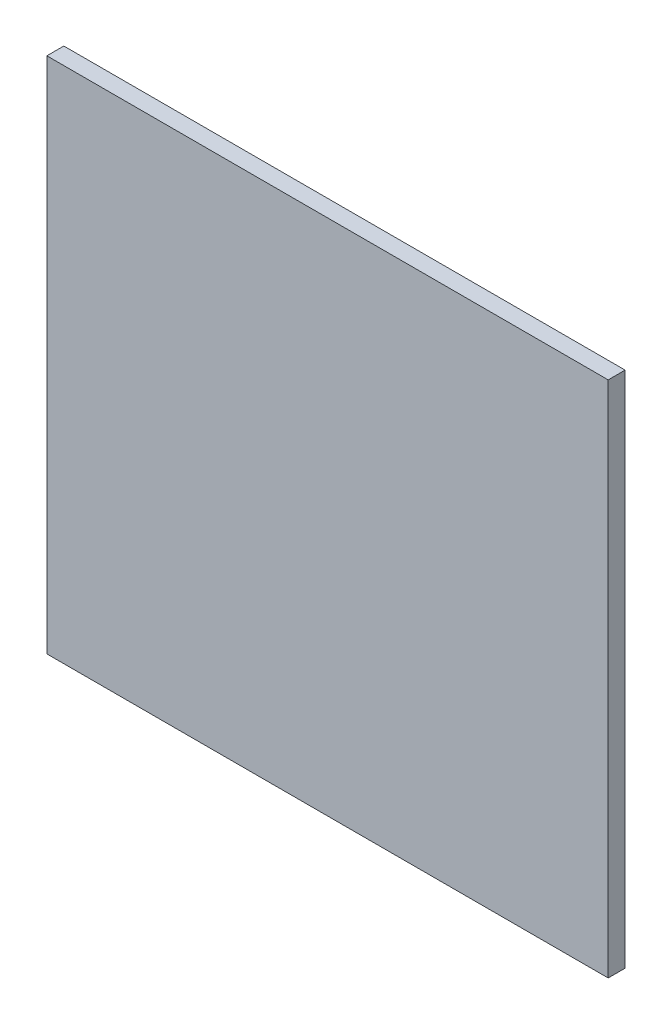
ISO-10303-21;
HEADER;
FILE_DESCRIPTION(('STEP AP214'),'2;1');
FILE_NAME('part.step','',(''),(''),'','','');
FILE_SCHEMA(('AUTOMOTIVE_DESIGN { 1 0 10303 214 1 1 1 1 }'));
ENDSEC;
DATA;
#1=APPLICATION_CONTEXT('core data for automotive mechanical design processes');
#2=APPLICATION_PROTOCOL_DEFINITION('international standard','automotive_design',2000,#1);
#3=PRODUCT_CONTEXT('',#1,'mechanical');
#4=PRODUCT('Part','Part','',(#3));
#5=PRODUCT_RELATED_PRODUCT_CATEGORY('part','',(#4));
#6=PRODUCT_DEFINITION_FORMATION('','',#4);
#7=PRODUCT_DEFINITION_CONTEXT('part definition',#1,'design');
#8=PRODUCT_DEFINITION('design','',#6,#7);
#9=PRODUCT_DEFINITION_SHAPE('','',#8);
#10=(LENGTH_UNIT() NAMED_UNIT(*) SI_UNIT(.MILLI.,.METRE.));
#11=(NAMED_UNIT(*) PLANE_ANGLE_UNIT() SI_UNIT($,.RADIAN.));
#12=(NAMED_UNIT(*) SI_UNIT($,.STERADIAN.) SOLID_ANGLE_UNIT());
#13=UNCERTAINTY_MEASURE_WITH_UNIT(LENGTH_MEASURE(1.E-05),#10,'distance_accuracy_value','');
#14=(GEOMETRIC_REPRESENTATION_CONTEXT(3) GLOBAL_UNCERTAINTY_ASSIGNED_CONTEXT((#13)) GLOBAL_UNIT_ASSIGNED_CONTEXT((#10,
#11,#12)) REPRESENTATION_CONTEXT('',''));
#15=CARTESIAN_POINT('',(0.,0.,0.));
#16=DIRECTION('',(0.,0.,1.));
#17=DIRECTION('',(1.,0.,0.));
#18=AXIS2_PLACEMENT_3D('',#15,#16,#17);
#19=CARTESIAN_POINT('',(-47.7511842591412,-36.5014710691867,18.));
#20=DIRECTION('',(1.,0.,0.));
#21=DIRECTION('',(0.,0.,-1.));
#22=AXIS2_PLACEMENT_3D('',#19,#20,#21);
#23=PLANE('',#22);
#24=DIRECTION('',(0.,-1.,0.));
#25=VECTOR('',#24,1.);
#26=CARTESIAN_POINT('',(-47.7511842591412,-36.5014710691867,0.));
#27=LINE('',#26,#25);
#28=CARTESIAN_POINT('',(-47.7511842591412,513.498528930813,0.));
#29=VERTEX_POINT('',#28);
#30=CARTESIAN_POINT('',(-47.7511842591412,-36.5014710691867,0.));
#31=VERTEX_POINT('',#30);
#32=EDGE_CURVE('E96',#29,#31,#27,.T.);
#33=ORIENTED_EDGE('',*,*,#32,.T.);
#34=DIRECTION('',(0.,0.,-1.));
#35=VECTOR('',#34,1.);
#36=CARTESIAN_POINT('',(-47.7511842591412,-36.5014710691867,18.));
#37=LINE('',#36,#35);
#38=CARTESIAN_POINT('',(-47.7511842591412,-36.5014710691867,18.));
#39=VERTEX_POINT('',#38);
#40=EDGE_CURVE('E11',#39,#31,#37,.T.);
#41=ORIENTED_EDGE('',*,*,#40,.F.);
#42=DIRECTION('',(0.,-1.,0.));
#43=VECTOR('',#42,1.);
#44=CARTESIAN_POINT('',(-47.7511842591412,-36.5014710691867,18.));
#45=LINE('',#44,#43);
#46=CARTESIAN_POINT('',(-47.7511842591412,513.498528930813,18.));
#47=VERTEX_POINT('',#46);
#48=EDGE_CURVE('E84',#47,#39,#45,.T.);
#49=ORIENTED_EDGE('',*,*,#48,.F.);
#50=DIRECTION('',(0.,0.,-1.));
#51=VECTOR('',#50,1.);
#52=CARTESIAN_POINT('',(-47.7511842591412,513.498528930813,18.));
#53=LINE('',#52,#51);
#54=EDGE_CURVE('E92',#47,#29,#53,.T.);
#55=ORIENTED_EDGE('',*,*,#54,.T.);
#56=EDGE_LOOP('',(#33,#41,#49,#55));
#57=FACE_BOUND('',#56,.T.);
#58=ADVANCED_FACE('F33',(#57),#23,.F.);
#59=CARTESIAN_POINT('',(548.248815740859,-36.5014710691866,18.));
#60=DIRECTION('',(0.,1.,0.));
#61=DIRECTION('',(-1.,0.,0.));
#62=AXIS2_PLACEMENT_3D('',#59,#60,#61);
#63=PLANE('',#62);
#64=DIRECTION('',(1.,0.,0.));
#65=VECTOR('',#64,1.);
#66=CARTESIAN_POINT('',(548.248815740859,-36.5014710691866,0.));
#67=LINE('',#66,#65);
#68=CARTESIAN_POINT('',(548.248815740859,-36.5014710691866,0.));
#69=VERTEX_POINT('',#68);
#70=EDGE_CURVE('E88',#31,#69,#67,.T.);
#71=ORIENTED_EDGE('',*,*,#70,.T.);
#72=DIRECTION('',(0.,0.,-1.));
#73=VECTOR('',#72,1.);
#74=CARTESIAN_POINT('',(548.248815740859,-36.5014710691866,18.));
#75=LINE('',#74,#73);
#76=CARTESIAN_POINT('',(548.248815740859,-36.5014710691866,18.));
#77=VERTEX_POINT('',#76);
#78=EDGE_CURVE('E41',#77,#69,#75,.T.);
#79=ORIENTED_EDGE('',*,*,#78,.F.);
#80=DIRECTION('',(1.,0.,0.));
#81=VECTOR('',#80,1.);
#82=CARTESIAN_POINT('',(548.248815740859,-36.5014710691866,18.));
#83=LINE('',#82,#81);
#84=EDGE_CURVE('E79',#39,#77,#83,.T.);
#85=ORIENTED_EDGE('',*,*,#84,.F.);
#86=ORIENTED_EDGE('',*,*,#40,.T.);
#87=EDGE_LOOP('',(#71,#79,#85,#86));
#88=FACE_BOUND('',#87,.T.);
#89=ADVANCED_FACE('F87',(#88),#63,.F.);
#90=CARTESIAN_POINT('',(548.248815740859,-36.5014710691866,18.));
#91=DIRECTION('',(-1.,0.,0.));
#92=DIRECTION('',(0.,0.,1.));
#93=AXIS2_PLACEMENT_3D('',#90,#91,#92);
#94=PLANE('',#93);
#95=DIRECTION('',(0.,1.,0.));
#96=VECTOR('',#95,1.);
#97=CARTESIAN_POINT('',(548.248815740859,-36.5014710691866,0.));
#98=LINE('',#97,#96);
#99=CARTESIAN_POINT('',(548.248815740859,513.498528930813,0.));
#100=VERTEX_POINT('',#99);
#101=EDGE_CURVE('E66',#69,#100,#98,.T.);
#102=ORIENTED_EDGE('',*,*,#101,.T.);
#103=DIRECTION('',(0.,0.,-1.));
#104=VECTOR('',#103,1.);
#105=CARTESIAN_POINT('',(548.248815740859,513.498528930813,18.));
#106=LINE('',#105,#104);
#107=CARTESIAN_POINT('',(548.248815740859,513.498528930813,18.));
#108=VERTEX_POINT('',#107);
#109=EDGE_CURVE('E89',#108,#100,#106,.T.);
#110=ORIENTED_EDGE('',*,*,#109,.F.);
#111=DIRECTION('',(0.,1.,0.));
#112=VECTOR('',#111,1.);
#113=CARTESIAN_POINT('',(548.248815740859,-36.5014710691866,18.));
#114=LINE('',#113,#112);
#115=EDGE_CURVE('E82',#77,#108,#114,.T.);
#116=ORIENTED_EDGE('',*,*,#115,.F.);
#117=ORIENTED_EDGE('',*,*,#78,.T.);
#118=EDGE_LOOP('',(#102,#110,#116,#117));
#119=FACE_BOUND('',#118,.T.);
#120=ADVANCED_FACE('F90',(#119),#94,.F.);
#121=CARTESIAN_POINT('',(548.248815740859,513.498528930813,18.));
#122=DIRECTION('',(0.,-1.,0.));
#123=DIRECTION('',(1.,0.,0.));
#124=AXIS2_PLACEMENT_3D('',#121,#122,#123);
#125=PLANE('',#124);
#126=DIRECTION('',(-1.,0.,0.));
#127=VECTOR('',#126,1.);
#128=CARTESIAN_POINT('',(548.248815740859,513.498528930813,0.));
#129=LINE('',#128,#127);
#130=EDGE_CURVE('E72',#100,#29,#129,.T.);
#131=ORIENTED_EDGE('',*,*,#130,.T.);
#132=ORIENTED_EDGE('',*,*,#54,.F.);
#133=DIRECTION('',(-1.,0.,0.));
#134=VECTOR('',#133,1.);
#135=CARTESIAN_POINT('',(548.248815740859,513.498528930813,18.));
#136=LINE('',#135,#134);
#137=EDGE_CURVE('E49',#108,#47,#136,.T.);
#138=ORIENTED_EDGE('',*,*,#137,.F.);
#139=ORIENTED_EDGE('',*,*,#109,.T.);
#140=EDGE_LOOP('',(#131,#132,#138,#139));
#141=FACE_BOUND('',#140,.T.);
#142=ADVANCED_FACE('F103',(#141),#125,.F.);
#143=CARTESIAN_POINT('',(0.,0.,18.));
#144=DIRECTION('',(0.,0.,1.));
#145=DIRECTION('',(1.,0.,0.));
#146=AXIS2_PLACEMENT_3D('',#143,#144,#145);
#147=PLANE('',#146);
#148=ORIENTED_EDGE('',*,*,#48,.T.);
#149=ORIENTED_EDGE('',*,*,#84,.T.);
#150=ORIENTED_EDGE('',*,*,#115,.T.);
#151=ORIENTED_EDGE('',*,*,#137,.T.);
#152=EDGE_LOOP('',(#148,#149,#150,#151));
#153=FACE_BOUND('',#152,.T.);
#154=ADVANCED_FACE('F80',(#153),#147,.T.);
#155=CARTESIAN_POINT('',(0.,0.,0.));
#156=DIRECTION('',(0.,0.,1.));
#157=DIRECTION('',(1.,0.,0.));
#158=AXIS2_PLACEMENT_3D('',#155,#156,#157);
#159=PLANE('',#158);
#160=ORIENTED_EDGE('',*,*,#32,.F.);
#161=ORIENTED_EDGE('',*,*,#130,.F.);
#162=ORIENTED_EDGE('',*,*,#101,.F.);
#163=ORIENTED_EDGE('',*,*,#70,.F.);
#164=EDGE_LOOP('',(#160,#161,#162,#163));
#165=FACE_BOUND('',#164,.T.);
#166=ADVANCED_FACE('F106',(#165),#159,.F.);
#167=CLOSED_SHELL('',(#58,#89,#120,#142,#154,#166));
#168=MANIFOLD_SOLID_BREP('B2',#167);
#169=ADVANCED_BREP_SHAPE_REPRESENTATION('',(#18,#168),#14);
#170=SHAPE_DEFINITION_REPRESENTATION(#9,#169);
ENDSEC;
END-ISO-10303-21;
